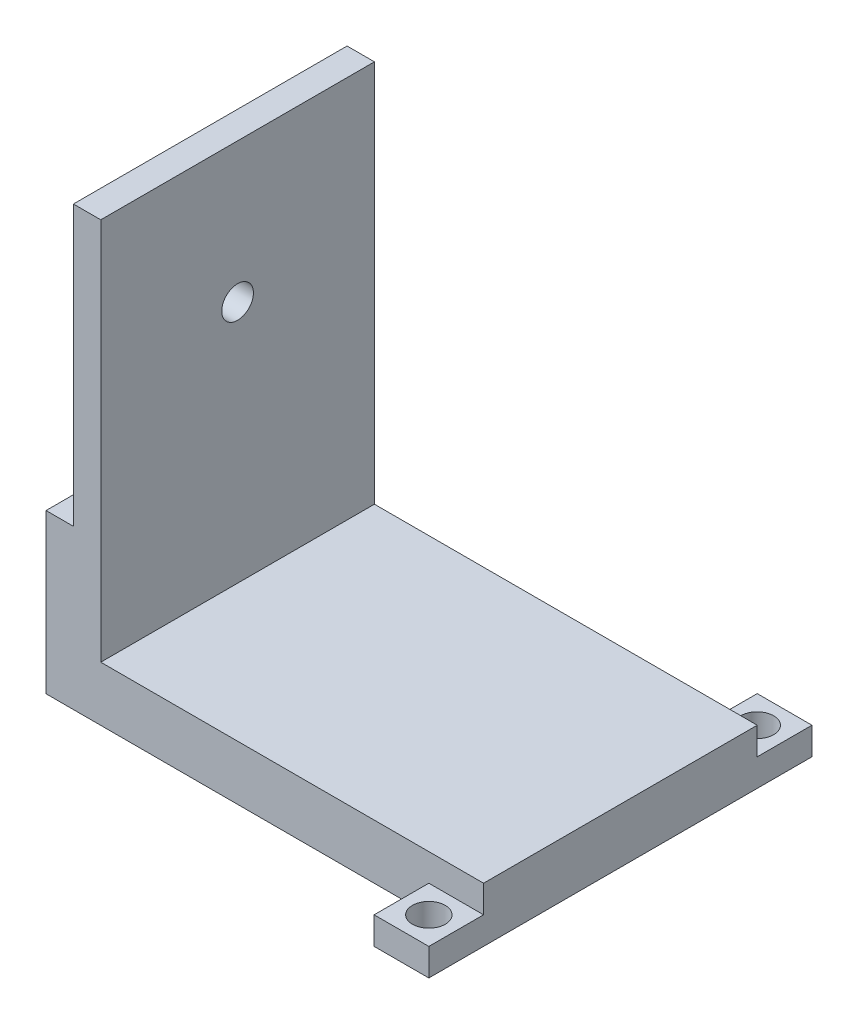
ISO-10303-21;
HEADER;
FILE_DESCRIPTION(('STEP AP214'),'2;1');
FILE_NAME('part.step','',(''),(''),'','','');
FILE_SCHEMA(('AUTOMOTIVE_DESIGN { 1 0 10303 214 1 1 1 1 }'));
ENDSEC;
DATA;
#1=APPLICATION_CONTEXT('core data for automotive mechanical design processes');
#2=APPLICATION_PROTOCOL_DEFINITION('international standard','automotive_design',2000,#1);
#3=PRODUCT_CONTEXT('',#1,'mechanical');
#4=PRODUCT('Part','Part','',(#3));
#5=PRODUCT_RELATED_PRODUCT_CATEGORY('part','',(#4));
#6=PRODUCT_DEFINITION_FORMATION('','',#4);
#7=PRODUCT_DEFINITION_CONTEXT('part definition',#1,'design');
#8=PRODUCT_DEFINITION('design','',#6,#7);
#9=PRODUCT_DEFINITION_SHAPE('','',#8);
#10=(LENGTH_UNIT() NAMED_UNIT(*) SI_UNIT(.MILLI.,.METRE.));
#11=(NAMED_UNIT(*) PLANE_ANGLE_UNIT() SI_UNIT($,.RADIAN.));
#12=(NAMED_UNIT(*) SI_UNIT($,.STERADIAN.) SOLID_ANGLE_UNIT());
#13=UNCERTAINTY_MEASURE_WITH_UNIT(LENGTH_MEASURE(1.E-05),#10,'distance_accuracy_value','');
#14=(GEOMETRIC_REPRESENTATION_CONTEXT(3) GLOBAL_UNCERTAINTY_ASSIGNED_CONTEXT((#13)) GLOBAL_UNIT_ASSIGNED_CONTEXT((#10,
#11,#12)) REPRESENTATION_CONTEXT('',''));
#15=CARTESIAN_POINT('',(0.,0.,0.));
#16=DIRECTION('',(0.,0.,1.));
#17=DIRECTION('',(1.,0.,0.));
#18=AXIS2_PLACEMENT_3D('',#15,#16,#17);
#19=CARTESIAN_POINT('',(0.,80000.,0.));
#20=DIRECTION('',(0.,-1.,0.));
#21=DIRECTION('',(0.,0.,-1.));
#22=AXIS2_PLACEMENT_3D('',#19,#20,#21);
#23=PLANE('',#22);
#24=DIRECTION('',(0.,0.,-1.));
#25=VECTOR('',#24,1.);
#26=CARTESIAN_POINT('',(2705.62328702654,80000.,-25769.8248879062));
#27=LINE('',#26,#25);
#28=CARTESIAN_POINT('',(2705.62328702654,80000.,24230.1751120937));
#29=VERTEX_POINT('',#28);
#30=CARTESIAN_POINT('',(2705.62328702654,80000.,-25769.8248879062));
#31=VERTEX_POINT('',#30);
#32=EDGE_CURVE('E151',#29,#31,#27,.T.);
#33=ORIENTED_EDGE('',*,*,#32,.F.);
#34=DIRECTION('',(1.,0.,0.));
#35=VECTOR('',#34,1.);
#36=CARTESIAN_POINT('',(-2294.37671297345,80000.,24230.1751120937));
#37=LINE('',#36,#35);
#38=CARTESIAN_POINT('',(7705.62328702655,80000.,24230.1751120937));
#39=VERTEX_POINT('',#38);
#40=EDGE_CURVE('E169',#29,#39,#37,.T.);
#41=ORIENTED_EDGE('',*,*,#40,.T.);
#42=DIRECTION('',(0.,0.,-1.));
#43=VECTOR('',#42,1.);
#44=CARTESIAN_POINT('',(7705.62328702655,80000.,24230.1751120937));
#45=LINE('',#44,#43);
#46=CARTESIAN_POINT('',(7705.62328702655,80000.,-25769.8248879062));
#47=VERTEX_POINT('',#46);
#48=EDGE_CURVE('E172',#39,#47,#45,.T.);
#49=ORIENTED_EDGE('',*,*,#48,.T.);
#50=DIRECTION('',(-1.,0.,0.));
#51=VECTOR('',#50,1.);
#52=CARTESIAN_POINT('',(-2294.37671297345,80000.,-25769.8248879062));
#53=LINE('',#52,#51);
#54=EDGE_CURVE('E175',#47,#31,#53,.T.);
#55=ORIENTED_EDGE('',*,*,#54,.T.);
#56=EDGE_LOOP('',(#33,#41,#49,#55));
#57=FACE_BOUND('',#56,.T.);
#58=ADVANCED_FACE('F38',(#57),#23,.F.);
#59=CARTESIAN_POINT('',(-2294.37671297346,10000.,-25769.8248879063));
#60=DIRECTION('',(0.,0.,1.));
#61=DIRECTION('',(1.,0.,0.));
#62=AXIS2_PLACEMENT_3D('',#59,#60,#61);
#63=PLANE('',#62);
#64=DIRECTION('',(0.,-1.,0.));
#65=VECTOR('',#64,1.);
#66=CARTESIAN_POINT('',(-2294.37671297346,10000.,-25769.8248879063));
#67=LINE('',#66,#65);
#68=CARTESIAN_POINT('',(-2294.37671297346,29000.,-25769.8248879062));
#69=VERTEX_POINT('',#68);
#70=CARTESIAN_POINT('',(-2294.37671297346,0.,-25769.8248879063));
#71=VERTEX_POINT('',#70);
#72=EDGE_CURVE('E47',#69,#71,#67,.T.);
#73=ORIENTED_EDGE('',*,*,#72,.F.);
#74=DIRECTION('',(-1.,0.,0.));
#75=VECTOR('',#74,1.);
#76=CARTESIAN_POINT('',(2705.62328702654,29000.,-25769.8248879062));
#77=LINE('',#76,#75);
#78=CARTESIAN_POINT('',(2705.62328702654,29000.,-25769.8248879062));
#79=VERTEX_POINT('',#78);
#80=EDGE_CURVE('E142',#79,#69,#77,.T.);
#81=ORIENTED_EDGE('',*,*,#80,.F.);
#82=DIRECTION('',(0.,-1.,0.));
#83=VECTOR('',#82,1.);
#84=CARTESIAN_POINT('',(2705.62328702654,80000.,-25769.8248879062));
#85=LINE('',#84,#83);
#86=EDGE_CURVE('E147',#31,#79,#85,.T.);
#87=ORIENTED_EDGE('',*,*,#86,.F.);
#88=ORIENTED_EDGE('',*,*,#54,.F.);
#89=DIRECTION('',(0.,-1.,0.));
#90=VECTOR('',#89,1.);
#91=CARTESIAN_POINT('',(7705.62328702655,80000.,-25769.8248879062));
#92=LINE('',#91,#90);
#93=CARTESIAN_POINT('',(7705.62328702655,10000.,-25769.8248879062));
#94=VERTEX_POINT('',#93);
#95=EDGE_CURVE('E178',#47,#94,#92,.T.);
#96=ORIENTED_EDGE('',*,*,#95,.T.);
#97=DIRECTION('',(-1.,0.,0.));
#98=VECTOR('',#97,1.);
#99=CARTESIAN_POINT('',(-2294.37671297346,10000.,-25769.8248879063));
#100=LINE('',#99,#98);
#101=CARTESIAN_POINT('',(77644.7876447877,10000.,-25769.8248879062));
#102=VERTEX_POINT('',#101);
#103=EDGE_CURVE('E283',#102,#94,#100,.T.);
#104=ORIENTED_EDGE('',*,*,#103,.F.);
#105=DIRECTION('',(0.,1.,0.));
#106=VECTOR('',#105,1.);
#107=CARTESIAN_POINT('',(77644.7876447877,5000.,-25769.8248879062));
#108=LINE('',#107,#106);
#109=CARTESIAN_POINT('',(77644.7876447877,5000.,-25769.8248879062));
#110=VERTEX_POINT('',#109);
#111=EDGE_CURVE('E217',#110,#102,#108,.T.);
#112=ORIENTED_EDGE('',*,*,#111,.F.);
#113=DIRECTION('',(1.,0.,0.));
#114=VECTOR('',#113,1.);
#115=CARTESIAN_POINT('',(77644.7876447877,5000.,-25769.8248879062));
#116=LINE('',#115,#114);
#117=CARTESIAN_POINT('',(67644.7876447877,5000.,-25769.8248879062));
#118=VERTEX_POINT('',#117);
#119=EDGE_CURVE('E213',#118,#110,#116,.T.);
#120=ORIENTED_EDGE('',*,*,#119,.F.);
#121=DIRECTION('',(0.,1.,0.));
#122=VECTOR('',#121,1.);
#123=CARTESIAN_POINT('',(67644.7876447877,0.,-25769.8248879063));
#124=LINE('',#123,#122);
#125=CARTESIAN_POINT('',(67644.7876447877,0.,-25769.8248879062));
#126=VERTEX_POINT('',#125);
#127=EDGE_CURVE('E221',#126,#118,#124,.T.);
#128=ORIENTED_EDGE('',*,*,#127,.F.);
#129=DIRECTION('',(-1.,0.,0.));
#130=VECTOR('',#129,1.);
#131=CARTESIAN_POINT('',(-2294.37671297346,0.,-25769.8248879063));
#132=LINE('',#131,#130);
#133=EDGE_CURVE('E279',#126,#71,#132,.T.);
#134=ORIENTED_EDGE('',*,*,#133,.T.);
#135=EDGE_LOOP('',(#73,#81,#87,#88,#96,#104,#112,#120,#128,#134));
#136=FACE_BOUND('',#135,.T.);
#137=ADVANCED_FACE('F159',(#136),#63,.F.);
#138=CARTESIAN_POINT('',(67647.2264073049,10000.,34230.1751120937));
#139=DIRECTION('',(1.,0.,0.));
#140=DIRECTION('',(0.,0.,-1.));
#141=AXIS2_PLACEMENT_3D('',#138,#139,#140);
#142=PLANE('',#141);
#143=DIRECTION('',(0.,0.,1.));
#144=VECTOR('',#143,1.);
#145=CARTESIAN_POINT('',(67647.2264073049,5000.,34230.1751120938));
#146=LINE('',#145,#144);
#147=CARTESIAN_POINT('',(67647.2264073049,5000.,24230.1751120938));
#148=VERTEX_POINT('',#147);
#149=CARTESIAN_POINT('',(67647.2264073049,5000.,34230.1751120937));
#150=VERTEX_POINT('',#149);
#151=EDGE_CURVE('E246',#148,#150,#146,.T.);
#152=ORIENTED_EDGE('',*,*,#151,.F.);
#153=DIRECTION('',(0.,-1.,0.));
#154=VECTOR('',#153,1.);
#155=CARTESIAN_POINT('',(67647.2264073049,10000.,24230.1751120937));
#156=LINE('',#155,#154);
#157=CARTESIAN_POINT('',(67647.2264073049,0.,24230.1751120937));
#158=VERTEX_POINT('',#157);
#159=EDGE_CURVE('E256',#148,#158,#156,.T.);
#160=ORIENTED_EDGE('',*,*,#159,.T.);
#161=DIRECTION('',(0.,0.,-1.));
#162=VECTOR('',#161,1.);
#163=CARTESIAN_POINT('',(67647.2264073049,0.,34230.1751120937));
#164=LINE('',#163,#162);
#165=CARTESIAN_POINT('',(67647.2264073049,0.,34230.1751120937));
#166=VERTEX_POINT('',#165);
#167=EDGE_CURVE('E268',#166,#158,#164,.T.);
#168=ORIENTED_EDGE('',*,*,#167,.F.);
#169=DIRECTION('',(0.,-1.,0.));
#170=VECTOR('',#169,1.);
#171=CARTESIAN_POINT('',(67647.2264073049,10000.,34230.1751120937));
#172=LINE('',#171,#170);
#173=EDGE_CURVE('E261',#150,#166,#172,.T.);
#174=ORIENTED_EDGE('',*,*,#173,.F.);
#175=EDGE_LOOP('',(#152,#160,#168,#174));
#176=FACE_BOUND('',#175,.T.);
#177=ADVANCED_FACE('F348',(#176),#142,.F.);
#178=CARTESIAN_POINT('',(0.,0.,34230.1751120937));
#179=DIRECTION('',(0.,0.,-1.));
#180=DIRECTION('',(-1.,0.,0.));
#181=AXIS2_PLACEMENT_3D('',#178,#179,#180);
#182=PLANE('',#181);
#183=DIRECTION('',(1.,0.,0.));
#184=VECTOR('',#183,1.);
#185=CARTESIAN_POINT('',(77644.7876447876,5000.,34230.1751120938));
#186=LINE('',#185,#184);
#187=CARTESIAN_POINT('',(77644.7876447876,5000.,34230.1751120938));
#188=VERTEX_POINT('',#187);
#189=EDGE_CURVE('E249',#150,#188,#186,.T.);
#190=ORIENTED_EDGE('',*,*,#189,.F.);
#191=ORIENTED_EDGE('',*,*,#173,.T.);
#192=DIRECTION('',(1.,0.,0.));
#193=VECTOR('',#192,1.);
#194=CARTESIAN_POINT('',(77644.7876447876,0.,34230.1751120937));
#195=LINE('',#194,#193);
#196=CARTESIAN_POINT('',(77644.7876447876,0.,34230.1751120937));
#197=VERTEX_POINT('',#196);
#198=EDGE_CURVE('E264',#166,#197,#195,.T.);
#199=ORIENTED_EDGE('',*,*,#198,.T.);
#200=DIRECTION('',(0.,1.,0.));
#201=VECTOR('',#200,1.);
#202=CARTESIAN_POINT('',(77644.7876447876,10000.,34230.1751120937));
#203=LINE('',#202,#201);
#204=EDGE_CURVE('E257',#197,#188,#203,.T.);
#205=ORIENTED_EDGE('',*,*,#204,.T.);
#206=EDGE_LOOP('',(#190,#191,#199,#205));
#207=FACE_BOUND('',#206,.T.);
#208=ADVANCED_FACE('F377',(#207),#182,.F.);
#209=CARTESIAN_POINT('',(-2294.37671297345,10000.,24230.1751120937));
#210=DIRECTION('',(0.,0.,-1.));
#211=DIRECTION('',(-1.,0.,0.));
#212=AXIS2_PLACEMENT_3D('',#209,#210,#211);
#213=PLANE('',#212);
#214=DIRECTION('',(0.,1.,0.));
#215=VECTOR('',#214,1.);
#216=CARTESIAN_POINT('',(2705.62328702655,80000.,24230.1751120937));
#217=LINE('',#216,#215);
#218=CARTESIAN_POINT('',(2705.62328702655,29000.,24230.1751120937));
#219=VERTEX_POINT('',#218);
#220=EDGE_CURVE('E54',#219,#29,#217,.T.);
#221=ORIENTED_EDGE('',*,*,#220,.F.);
#222=DIRECTION('',(-1.,0.,0.));
#223=VECTOR('',#222,1.);
#224=CARTESIAN_POINT('',(2705.62328702655,29000.,24230.1751120937));
#225=LINE('',#224,#223);
#226=CARTESIAN_POINT('',(-2294.37671297345,29000.,24230.1751120937));
#227=VERTEX_POINT('',#226);
#228=EDGE_CURVE('E145',#219,#227,#225,.T.);
#229=ORIENTED_EDGE('',*,*,#228,.T.);
#230=DIRECTION('',(0.,-1.,0.));
#231=VECTOR('',#230,1.);
#232=CARTESIAN_POINT('',(-2294.37671297345,10000.,24230.1751120937));
#233=LINE('',#232,#231);
#234=CARTESIAN_POINT('',(-2294.37671297345,0.,24230.1751120937));
#235=VERTEX_POINT('',#234);
#236=EDGE_CURVE('E11',#227,#235,#233,.T.);
#237=ORIENTED_EDGE('',*,*,#236,.T.);
#238=DIRECTION('',(1.,0.,0.));
#239=VECTOR('',#238,1.);
#240=CARTESIAN_POINT('',(-2294.37671297345,0.,24230.1751120937));
#241=LINE('',#240,#239);
#242=EDGE_CURVE('E289',#235,#158,#241,.T.);
#243=ORIENTED_EDGE('',*,*,#242,.T.);
#244=ORIENTED_EDGE('',*,*,#159,.F.);
#245=DIRECTION('',(-1.,0.,0.));
#246=VECTOR('',#245,1.);
#247=CARTESIAN_POINT('',(77644.7876447876,5000.,24230.1751120938));
#248=LINE('',#247,#246);
#249=CARTESIAN_POINT('',(77644.7876447876,5000.,24230.1751120938));
#250=VERTEX_POINT('',#249);
#251=EDGE_CURVE('E243',#250,#148,#248,.T.);
#252=ORIENTED_EDGE('',*,*,#251,.F.);
#253=DIRECTION('',(0.,1.,0.));
#254=VECTOR('',#253,1.);
#255=CARTESIAN_POINT('',(77644.7876447876,5000.,24230.1751120938));
#256=LINE('',#255,#254);
#257=CARTESIAN_POINT('',(77644.7876447876,10000.,24230.1751120938));
#258=VERTEX_POINT('',#257);
#259=EDGE_CURVE('E252',#250,#258,#256,.T.);
#260=ORIENTED_EDGE('',*,*,#259,.T.);
#261=DIRECTION('',(1.,0.,0.));
#262=VECTOR('',#261,1.);
#263=CARTESIAN_POINT('',(-2294.37671297345,10000.,24230.1751120937));
#264=LINE('',#263,#262);
#265=CARTESIAN_POINT('',(7705.62328702655,10000.,24230.1751120938));
#266=VERTEX_POINT('',#265);
#267=EDGE_CURVE('E275',#266,#258,#264,.T.);
#268=ORIENTED_EDGE('',*,*,#267,.F.);
#269=DIRECTION('',(0.,-1.,0.));
#270=VECTOR('',#269,1.);
#271=CARTESIAN_POINT('',(7705.62328702655,80000.,24230.1751120937));
#272=LINE('',#271,#270);
#273=EDGE_CURVE('E184',#39,#266,#272,.T.);
#274=ORIENTED_EDGE('',*,*,#273,.F.);
#275=ORIENTED_EDGE('',*,*,#40,.F.);
#276=EDGE_LOOP('',(#221,#229,#237,#243,#244,#252,#260,#268,#274,#275));
#277=FACE_BOUND('',#276,.T.);
#278=ADVANCED_FACE('F312',(#277),#213,.F.);
#279=CARTESIAN_POINT('',(-2294.37671297346,10000.,-25769.8248879063));
#280=DIRECTION('',(1.,0.,0.));
#281=DIRECTION('',(0.,0.,-1.));
#282=AXIS2_PLACEMENT_3D('',#279,#280,#281);
#283=PLANE('',#282);
#284=ORIENTED_EDGE('',*,*,#236,.F.);
#285=DIRECTION('',(0.,0.,1.));
#286=VECTOR('',#285,1.);
#287=CARTESIAN_POINT('',(-2294.37671297346,29000.,-25769.8248879062));
#288=LINE('',#287,#286);
#289=EDGE_CURVE('E156',#69,#227,#288,.T.);
#290=ORIENTED_EDGE('',*,*,#289,.F.);
#291=ORIENTED_EDGE('',*,*,#72,.T.);
#292=DIRECTION('',(0.,0.,1.));
#293=VECTOR('',#292,1.);
#294=CARTESIAN_POINT('',(-2294.37671297346,0.,-25769.8248879063));
#295=LINE('',#294,#293);
#296=EDGE_CURVE('E274',#71,#235,#295,.T.);
#297=ORIENTED_EDGE('',*,*,#296,.T.);
#298=EDGE_LOOP('',(#284,#290,#291,#297));
#299=FACE_BOUND('',#298,.T.);
#300=ADVANCED_FACE('F40',(#299),#283,.F.);
#301=CARTESIAN_POINT('',(77644.7876447876,10000.,-25769.8248879062));
#302=DIRECTION('',(-1.,0.,0.));
#303=DIRECTION('',(0.,0.,1.));
#304=AXIS2_PLACEMENT_3D('',#301,#302,#303);
#305=PLANE('',#304);
#306=DIRECTION('',(0.,0.,-1.));
#307=VECTOR('',#306,1.);
#308=CARTESIAN_POINT('',(77644.7876447877,5000.,-35769.8248879062));
#309=LINE('',#308,#307);
#310=CARTESIAN_POINT('',(77644.7876447877,5000.,-35769.8248879063));
#311=VERTEX_POINT('',#310);
#312=EDGE_CURVE('E201',#110,#311,#309,.T.);
#313=ORIENTED_EDGE('',*,*,#312,.F.);
#314=ORIENTED_EDGE('',*,*,#111,.T.);
#315=DIRECTION('',(0.,0.,-1.));
#316=VECTOR('',#315,1.);
#317=CARTESIAN_POINT('',(77644.7876447876,10000.,-25769.8248879062));
#318=LINE('',#317,#316);
#319=EDGE_CURVE('E278',#258,#102,#318,.T.);
#320=ORIENTED_EDGE('',*,*,#319,.F.);
#321=ORIENTED_EDGE('',*,*,#259,.F.);
#322=DIRECTION('',(0.,0.,-1.));
#323=VECTOR('',#322,1.);
#324=CARTESIAN_POINT('',(77644.7876447876,5000.,34230.1751120938));
#325=LINE('',#324,#323);
#326=EDGE_CURVE('E239',#188,#250,#325,.T.);
#327=ORIENTED_EDGE('',*,*,#326,.F.);
#328=ORIENTED_EDGE('',*,*,#204,.F.);
#329=DIRECTION('',(0.,0.,-1.));
#330=VECTOR('',#329,1.);
#331=CARTESIAN_POINT('',(77644.7876447876,0.,-25769.8248879062));
#332=LINE('',#331,#330);
#333=CARTESIAN_POINT('',(77644.7876447877,0.,-35769.8248879063));
#334=VERTEX_POINT('',#333);
#335=EDGE_CURVE('E293',#197,#334,#332,.T.);
#336=ORIENTED_EDGE('',*,*,#335,.T.);
#337=DIRECTION('',(0.,-1.,0.));
#338=VECTOR('',#337,1.);
#339=CARTESIAN_POINT('',(77644.7876447877,0.,-35769.8248879063));
#340=LINE('',#339,#338);
#341=EDGE_CURVE('E222',#311,#334,#340,.T.);
#342=ORIENTED_EDGE('',*,*,#341,.F.);
#343=EDGE_LOOP('',(#313,#314,#320,#321,#327,#328,#336,#342));
#344=FACE_BOUND('',#343,.T.);
#345=ADVANCED_FACE('F387',(#344),#305,.F.);
#346=CARTESIAN_POINT('',(0.,10000.,0.));
#347=DIRECTION('',(0.,1.,0.));
#348=DIRECTION('',(0.,0.,1.));
#349=AXIS2_PLACEMENT_3D('',#346,#347,#348);
#350=PLANE('',#349);
#351=DIRECTION('',(0.,0.,-1.));
#352=VECTOR('',#351,1.);
#353=CARTESIAN_POINT('',(7705.62328702655,10000.,24230.1751120937));
#354=LINE('',#353,#352);
#355=EDGE_CURVE('E62',#266,#94,#354,.T.);
#356=ORIENTED_EDGE('',*,*,#355,.F.);
#357=ORIENTED_EDGE('',*,*,#267,.T.);
#358=ORIENTED_EDGE('',*,*,#319,.T.);
#359=ORIENTED_EDGE('',*,*,#103,.T.);
#360=EDGE_LOOP('',(#356,#357,#358,#359));
#361=FACE_BOUND('',#360,.T.);
#362=ADVANCED_FACE('F384',(#361),#350,.T.);
#363=CARTESIAN_POINT('',(0.,0.,0.));
#364=DIRECTION('',(0.,1.,0.));
#365=DIRECTION('',(0.,0.,1.));
#366=AXIS2_PLACEMENT_3D('',#363,#364,#365);
#367=PLANE('',#366);
#368=CARTESIAN_POINT('',(72644.7876447877,0.,-30769.8248879062));
#369=DIRECTION('',(0.,1.,0.));
#370=DIRECTION('',(0.,0.,1.));
#371=AXIS2_PLACEMENT_3D('',#368,#369,#370);
#372=CIRCLE('',#371,3000.);
#373=CARTESIAN_POINT('',(72644.7876447877,0.,-27769.8248879062));
#374=VERTEX_POINT('',#373);
#375=EDGE_CURVE('E189',#374,#374,#372,.T.);
#376=ORIENTED_EDGE('',*,*,#375,.T.);
#377=EDGE_LOOP('',(#376));
#378=FACE_BOUND('',#377,.T.);
#379=CARTESIAN_POINT('',(72646.0070260463,0.,29230.1751120938));
#380=DIRECTION('',(0.,1.,0.));
#381=DIRECTION('',(0.,0.,1.));
#382=AXIS2_PLACEMENT_3D('',#379,#380,#381);
#383=CIRCLE('',#382,3000.);
#384=CARTESIAN_POINT('',(72646.0070260463,0.,32230.1751120938));
#385=VERTEX_POINT('',#384);
#386=EDGE_CURVE('E197',#385,#385,#383,.T.);
#387=ORIENTED_EDGE('',*,*,#386,.T.);
#388=EDGE_LOOP('',(#387));
#389=FACE_BOUND('',#388,.T.);
#390=ORIENTED_EDGE('',*,*,#296,.F.);
#391=ORIENTED_EDGE('',*,*,#133,.F.);
#392=DIRECTION('',(0.,0.,1.));
#393=VECTOR('',#392,1.);
#394=CARTESIAN_POINT('',(67644.7876447877,0.,-35769.8248879063));
#395=LINE('',#394,#393);
#396=CARTESIAN_POINT('',(67644.7876447877,0.,-35769.8248879063));
#397=VERTEX_POINT('',#396);
#398=EDGE_CURVE('E232',#397,#126,#395,.T.);
#399=ORIENTED_EDGE('',*,*,#398,.F.);
#400=DIRECTION('',(-1.,0.,0.));
#401=VECTOR('',#400,1.);
#402=CARTESIAN_POINT('',(77644.7876447877,0.,-35769.8248879063));
#403=LINE('',#402,#401);
#404=EDGE_CURVE('E225',#334,#397,#403,.T.);
#405=ORIENTED_EDGE('',*,*,#404,.F.);
#406=ORIENTED_EDGE('',*,*,#335,.F.);
#407=ORIENTED_EDGE('',*,*,#198,.F.);
#408=ORIENTED_EDGE('',*,*,#167,.T.);
#409=ORIENTED_EDGE('',*,*,#242,.F.);
#410=EDGE_LOOP('',(#390,#391,#399,#405,#406,#407,#408,#409));
#411=FACE_BOUND('',#410,.T.);
#412=ADVANCED_FACE('F307',(#378,#389,#411),#367,.F.);
#413=CARTESIAN_POINT('',(0.,5000.,0.));
#414=DIRECTION('',(0.,1.,0.));
#415=DIRECTION('',(0.,0.,1.));
#416=AXIS2_PLACEMENT_3D('',#413,#414,#415);
#417=PLANE('',#416);
#418=CARTESIAN_POINT('',(72646.0070260463,5000.,29230.1751120938));
#419=DIRECTION('',(0.,1.,0.));
#420=DIRECTION('',(0.,0.,1.));
#421=AXIS2_PLACEMENT_3D('',#418,#419,#420);
#422=CIRCLE('',#421,3000.);
#423=CARTESIAN_POINT('',(72646.0070260463,5000.,32230.1751120938));
#424=VERTEX_POINT('',#423);
#425=EDGE_CURVE('E193',#424,#424,#422,.T.);
#426=ORIENTED_EDGE('',*,*,#425,.F.);
#427=EDGE_LOOP('',(#426));
#428=FACE_BOUND('',#427,.T.);
#429=ORIENTED_EDGE('',*,*,#326,.T.);
#430=ORIENTED_EDGE('',*,*,#251,.T.);
#431=ORIENTED_EDGE('',*,*,#151,.T.);
#432=ORIENTED_EDGE('',*,*,#189,.T.);
#433=EDGE_LOOP('',(#429,#430,#431,#432));
#434=FACE_BOUND('',#433,.T.);
#435=ADVANCED_FACE('F372',(#428,#434),#417,.T.);
#436=CARTESIAN_POINT('',(67644.7876447877,0.,-35769.8248879063));
#437=DIRECTION('',(1.,0.,0.));
#438=DIRECTION('',(0.,0.,-1.));
#439=AXIS2_PLACEMENT_3D('',#436,#437,#438);
#440=PLANE('',#439);
#441=ORIENTED_EDGE('',*,*,#127,.T.);
#442=DIRECTION('',(0.,0.,1.));
#443=VECTOR('',#442,1.);
#444=CARTESIAN_POINT('',(67644.7876447877,5000.,-35769.8248879062));
#445=LINE('',#444,#443);
#446=CARTESIAN_POINT('',(67644.7876447877,5000.,-35769.8248879062));
#447=VERTEX_POINT('',#446);
#448=EDGE_CURVE('E210',#447,#118,#445,.T.);
#449=ORIENTED_EDGE('',*,*,#448,.F.);
#450=DIRECTION('',(0.,1.,0.));
#451=VECTOR('',#450,1.);
#452=CARTESIAN_POINT('',(67644.7876447877,0.,-35769.8248879063));
#453=LINE('',#452,#451);
#454=EDGE_CURVE('E228',#397,#447,#453,.T.);
#455=ORIENTED_EDGE('',*,*,#454,.F.);
#456=ORIENTED_EDGE('',*,*,#398,.T.);
#457=EDGE_LOOP('',(#441,#449,#455,#456));
#458=FACE_BOUND('',#457,.T.);
#459=ADVANCED_FACE('F368',(#458),#440,.F.);
#460=CARTESIAN_POINT('',(0.,0.,-35769.8248879063));
#461=DIRECTION('',(0.,0.,1.));
#462=DIRECTION('',(1.,0.,0.));
#463=AXIS2_PLACEMENT_3D('',#460,#461,#462);
#464=PLANE('',#463);
#465=ORIENTED_EDGE('',*,*,#454,.T.);
#466=DIRECTION('',(-1.,0.,0.));
#467=VECTOR('',#466,1.);
#468=CARTESIAN_POINT('',(77644.7876447877,5000.,-35769.8248879062));
#469=LINE('',#468,#467);
#470=EDGE_CURVE('E207',#311,#447,#469,.T.);
#471=ORIENTED_EDGE('',*,*,#470,.F.);
#472=ORIENTED_EDGE('',*,*,#341,.T.);
#473=ORIENTED_EDGE('',*,*,#404,.T.);
#474=EDGE_LOOP('',(#465,#471,#472,#473));
#475=FACE_BOUND('',#474,.T.);
#476=ADVANCED_FACE('F364',(#475),#464,.F.);
#477=CARTESIAN_POINT('',(0.,5000.,0.));
#478=DIRECTION('',(0.,-1.,0.));
#479=DIRECTION('',(0.,0.,-1.));
#480=AXIS2_PLACEMENT_3D('',#477,#478,#479);
#481=PLANE('',#480);
#482=CARTESIAN_POINT('',(72644.7876447877,5000.,-30769.8248879062));
#483=DIRECTION('',(0.,1.,0.));
#484=DIRECTION('',(0.,0.,1.));
#485=AXIS2_PLACEMENT_3D('',#482,#483,#484);
#486=CIRCLE('',#485,3000.);
#487=CARTESIAN_POINT('',(72644.7876447877,5000.,-27769.8248879062));
#488=VERTEX_POINT('',#487);
#489=EDGE_CURVE('E188',#488,#488,#486,.T.);
#490=ORIENTED_EDGE('',*,*,#489,.F.);
#491=EDGE_LOOP('',(#490));
#492=FACE_BOUND('',#491,.T.);
#493=ORIENTED_EDGE('',*,*,#312,.T.);
#494=ORIENTED_EDGE('',*,*,#470,.T.);
#495=ORIENTED_EDGE('',*,*,#448,.T.);
#496=ORIENTED_EDGE('',*,*,#119,.T.);
#497=EDGE_LOOP('',(#493,#494,#495,#496));
#498=FACE_BOUND('',#497,.T.);
#499=ADVANCED_FACE('F360',(#492,#498),#481,.F.);
#500=CARTESIAN_POINT('',(72646.0070260463,0.,29230.1751120938));
#501=DIRECTION('',(0.,1.,0.));
#502=DIRECTION('',(0.,0.,1.));
#503=AXIS2_PLACEMENT_3D('',#500,#501,#502);
#504=CYLINDRICAL_SURFACE('',#503,3000.);
#505=ORIENTED_EDGE('',*,*,#386,.F.);
#506=EDGE_LOOP('',(#505));
#507=FACE_BOUND('',#506,.T.);
#508=ORIENTED_EDGE('',*,*,#425,.T.);
#509=EDGE_LOOP('',(#508));
#510=FACE_BOUND('',#509,.T.);
#511=ADVANCED_FACE('F356',(#507,#510),#504,.F.);
#512=CARTESIAN_POINT('',(72644.7876447877,0.,-30769.8248879062));
#513=DIRECTION('',(0.,1.,0.));
#514=DIRECTION('',(0.,0.,1.));
#515=AXIS2_PLACEMENT_3D('',#512,#513,#514);
#516=CYLINDRICAL_SURFACE('',#515,3000.);
#517=ORIENTED_EDGE('',*,*,#375,.F.);
#518=EDGE_LOOP('',(#517));
#519=FACE_BOUND('',#518,.T.);
#520=ORIENTED_EDGE('',*,*,#489,.T.);
#521=EDGE_LOOP('',(#520));
#522=FACE_BOUND('',#521,.T.);
#523=ADVANCED_FACE('F353',(#519,#522),#516,.F.);
#524=CARTESIAN_POINT('',(7705.62328702655,80000.,24230.1751120937));
#525=DIRECTION('',(-1.,0.,0.));
#526=DIRECTION('',(0.,0.,1.));
#527=AXIS2_PLACEMENT_3D('',#524,#525,#526);
#528=PLANE('',#527);
#529=CARTESIAN_POINT('',(7705.62328702654,54500.,-769.82488790624));
#530=DIRECTION('',(-1.,0.,0.));
#531=DIRECTION('',(0.,0.,1.));
#532=AXIS2_PLACEMENT_3D('',#529,#530,#531);
#533=CIRCLE('',#532,2894.02462587764);
#534=CARTESIAN_POINT('',(7705.62328702654,54500.,2124.1997379714));
#535=VERTEX_POINT('',#534);
#536=EDGE_CURVE('E318',#535,#535,#533,.T.);
#537=ORIENTED_EDGE('',*,*,#536,.T.);
#538=EDGE_LOOP('',(#537));
#539=FACE_BOUND('',#538,.T.);
#540=ORIENTED_EDGE('',*,*,#355,.T.);
#541=ORIENTED_EDGE('',*,*,#95,.F.);
#542=ORIENTED_EDGE('',*,*,#48,.F.);
#543=ORIENTED_EDGE('',*,*,#273,.T.);
#544=EDGE_LOOP('',(#540,#541,#542,#543));
#545=FACE_BOUND('',#544,.T.);
#546=ADVANCED_FACE('F340',(#539,#545),#528,.F.);
#547=CARTESIAN_POINT('',(2705.62328702654,29000.,-25769.8248879062));
#548=DIRECTION('',(0.,-1.,0.));
#549=DIRECTION('',(0.,0.,-1.));
#550=AXIS2_PLACEMENT_3D('',#547,#548,#549);
#551=PLANE('',#550);
#552=ORIENTED_EDGE('',*,*,#289,.T.);
#553=ORIENTED_EDGE('',*,*,#228,.F.);
#554=DIRECTION('',(0.,0.,1.));
#555=VECTOR('',#554,1.);
#556=CARTESIAN_POINT('',(2705.62328702654,29000.,-25769.8248879062));
#557=LINE('',#556,#555);
#558=EDGE_CURVE('E138',#79,#219,#557,.T.);
#559=ORIENTED_EDGE('',*,*,#558,.F.);
#560=ORIENTED_EDGE('',*,*,#80,.T.);
#561=EDGE_LOOP('',(#552,#553,#559,#560));
#562=FACE_BOUND('',#561,.T.);
#563=ADVANCED_FACE('F140',(#562),#551,.F.);
#564=CARTESIAN_POINT('',(2705.62328702654,0.,-3.36430670152513E-13));
#565=DIRECTION('',(-1.,0.,0.));
#566=DIRECTION('',(0.,0.,1.));
#567=AXIS2_PLACEMENT_3D('',#564,#565,#566);
#568=PLANE('',#567);
#569=CARTESIAN_POINT('',(2705.62328702654,54500.,-769.824887906239));
#570=DIRECTION('',(-1.,0.,0.));
#571=DIRECTION('',(0.,0.,1.));
#572=AXIS2_PLACEMENT_3D('',#569,#570,#571);
#573=CIRCLE('',#572,2894.02462587764);
#574=CARTESIAN_POINT('',(2705.62328702654,54500.,2124.1997379714));
#575=VERTEX_POINT('',#574);
#576=EDGE_CURVE('E321',#575,#575,#573,.T.);
#577=ORIENTED_EDGE('',*,*,#576,.F.);
#578=EDGE_LOOP('',(#577));
#579=FACE_BOUND('',#578,.T.);
#580=ORIENTED_EDGE('',*,*,#86,.T.);
#581=ORIENTED_EDGE('',*,*,#558,.T.);
#582=ORIENTED_EDGE('',*,*,#220,.T.);
#583=ORIENTED_EDGE('',*,*,#32,.T.);
#584=EDGE_LOOP('',(#580,#581,#582,#583));
#585=FACE_BOUND('',#584,.T.);
#586=ADVANCED_FACE('F150',(#579,#585),#568,.T.);
#587=CARTESIAN_POINT('',(7705.62328702654,54500.,-769.82488790624));
#588=DIRECTION('',(-1.,0.,0.));
#589=DIRECTION('',(0.,0.,1.));
#590=AXIS2_PLACEMENT_3D('',#587,#588,#589);
#591=CYLINDRICAL_SURFACE('',#590,2894.02462587764);
#592=ORIENTED_EDGE('',*,*,#536,.F.);
#593=EDGE_LOOP('',(#592));
#594=FACE_BOUND('',#593,.T.);
#595=ORIENTED_EDGE('',*,*,#576,.T.);
#596=EDGE_LOOP('',(#595));
#597=FACE_BOUND('',#596,.T.);
#598=ADVANCED_FACE('F330',(#594,#597),#591,.F.);
#599=CLOSED_SHELL('',(#58,#137,#177,#208,#278,#300,#345,#362,#412,#435,#459,#476,#499,#511,#523,
#546,#563,#586,#598));
#600=MANIFOLD_SOLID_BREP('B2',#599);
#601=ADVANCED_BREP_SHAPE_REPRESENTATION('',(#18,#600),#14);
#602=SHAPE_DEFINITION_REPRESENTATION(#9,#601);
ENDSEC;
END-ISO-10303-21;
